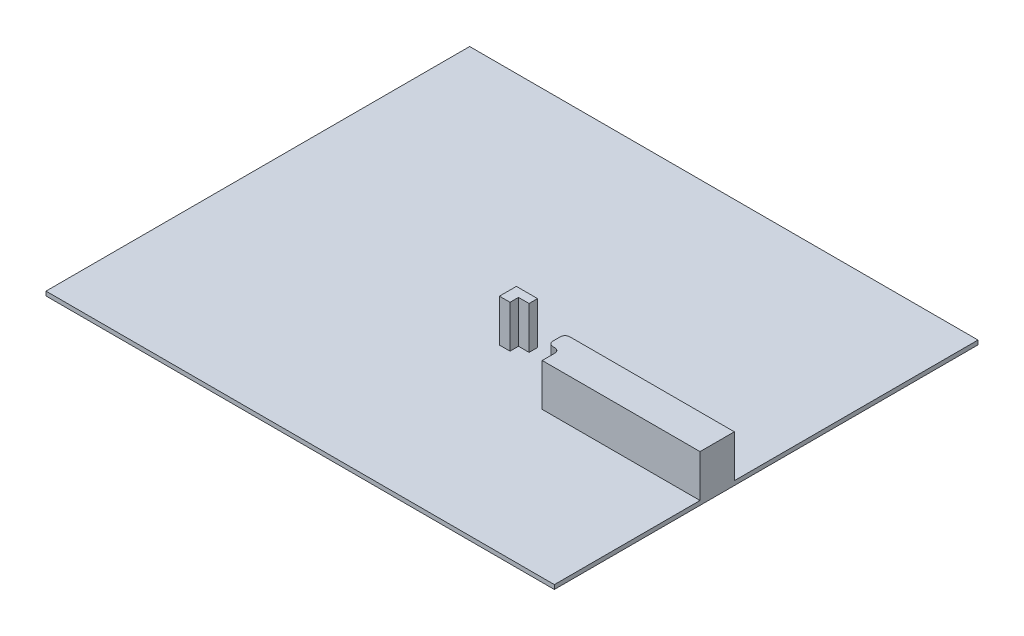
ISO-10303-21;
HEADER;
FILE_DESCRIPTION(('STEP AP214'),'2;1');
FILE_NAME('part.step','',(''),(''),'','','');
FILE_SCHEMA(('AUTOMOTIVE_DESIGN { 1 0 10303 214 1 1 1 1 }'));
ENDSEC;
DATA;
#1=APPLICATION_CONTEXT('core data for automotive mechanical design processes');
#2=APPLICATION_PROTOCOL_DEFINITION('international standard','automotive_design',2000,#1);
#3=PRODUCT_CONTEXT('',#1,'mechanical');
#4=PRODUCT('Part','Part','',(#3));
#5=PRODUCT_RELATED_PRODUCT_CATEGORY('part','',(#4));
#6=PRODUCT_DEFINITION_FORMATION('','',#4);
#7=PRODUCT_DEFINITION_CONTEXT('part definition',#1,'design');
#8=PRODUCT_DEFINITION('design','',#6,#7);
#9=PRODUCT_DEFINITION_SHAPE('','',#8);
#10=(LENGTH_UNIT() NAMED_UNIT(*) SI_UNIT(.MILLI.,.METRE.));
#11=(NAMED_UNIT(*) PLANE_ANGLE_UNIT() SI_UNIT($,.RADIAN.));
#12=(NAMED_UNIT(*) SI_UNIT($,.STERADIAN.) SOLID_ANGLE_UNIT());
#13=UNCERTAINTY_MEASURE_WITH_UNIT(LENGTH_MEASURE(1.E-05),#10,'distance_accuracy_value','');
#14=(GEOMETRIC_REPRESENTATION_CONTEXT(3) GLOBAL_UNCERTAINTY_ASSIGNED_CONTEXT((#13)) GLOBAL_UNIT_ASSIGNED_CONTEXT((#10,
#11,#12)) REPRESENTATION_CONTEXT('',''));
#15=CARTESIAN_POINT('',(0.,0.,0.));
#16=DIRECTION('',(0.,0.,1.));
#17=DIRECTION('',(1.,0.,0.));
#18=AXIS2_PLACEMENT_3D('',#15,#16,#17);
#19=CARTESIAN_POINT('',(0.,10.,0.));
#20=DIRECTION('',(0.,-1.,0.));
#21=DIRECTION('',(0.,0.,-1.));
#22=AXIS2_PLACEMENT_3D('',#19,#20,#21);
#23=PLANE('',#22);
#24=DIRECTION('',(-1.,0.,0.));
#25=VECTOR('',#24,1.);
#26=CARTESIAN_POINT('',(600.,10.,75.1731309306793));
#27=LINE('',#26,#25);
#28=CARTESIAN_POINT('',(600.,10.,75.1731309306793));
#29=VERTEX_POINT('',#28);
#30=CARTESIAN_POINT('',(211.500312891236,10.,75.1731309306794));
#31=VERTEX_POINT('',#30);
#32=EDGE_CURVE('E186',#29,#31,#27,.T.);
#33=ORIENTED_EDGE('',*,*,#32,.F.);
#34=DIRECTION('',(0.,0.,-1.));
#35=VECTOR('',#34,1.);
#36=CARTESIAN_POINT('',(600.,10.,500.));
#37=LINE('',#36,#35);
#38=CARTESIAN_POINT('',(600.,10.,-500.));
#39=VERTEX_POINT('',#38);
#40=EDGE_CURVE('E279',#29,#39,#37,.T.);
#41=ORIENTED_EDGE('',*,*,#40,.T.);
#42=DIRECTION('',(-1.,0.,0.));
#43=VECTOR('',#42,1.);
#44=CARTESIAN_POINT('',(-600.,10.,-500.));
#45=LINE('',#44,#43);
#46=CARTESIAN_POINT('',(-600.,10.,-500.));
#47=VERTEX_POINT('',#46);
#48=EDGE_CURVE('E275',#39,#47,#45,.T.);
#49=ORIENTED_EDGE('',*,*,#48,.T.);
#50=DIRECTION('',(0.,0.,1.));
#51=VECTOR('',#50,1.);
#52=CARTESIAN_POINT('',(-600.,10.,500.));
#53=LINE('',#52,#51);
#54=CARTESIAN_POINT('',(-600.,10.,500.));
#55=VERTEX_POINT('',#54);
#56=EDGE_CURVE('E301',#47,#55,#53,.T.);
#57=ORIENTED_EDGE('',*,*,#56,.T.);
#58=DIRECTION('',(1.,0.,0.));
#59=VECTOR('',#58,1.);
#60=CARTESIAN_POINT('',(-600.,10.,500.));
#61=LINE('',#60,#59);
#62=CARTESIAN_POINT('',(600.,10.,500.));
#63=VERTEX_POINT('',#62);
#64=EDGE_CURVE('E291',#55,#63,#61,.T.);
#65=ORIENTED_EDGE('',*,*,#64,.T.);
#66=CARTESIAN_POINT('',(600.,10.,156.173130930679));
#67=VERTEX_POINT('',#66);
#68=EDGE_CURVE('E281',#63,#67,#37,.T.);
#69=ORIENTED_EDGE('',*,*,#68,.T.);
#70=DIRECTION('',(1.,0.,0.));
#71=VECTOR('',#70,1.);
#72=CARTESIAN_POINT('',(227.500312891236,10.,156.173130930679));
#73=LINE('',#72,#71);
#74=CARTESIAN_POINT('',(227.500312891236,10.,156.173130930679));
#75=VERTEX_POINT('',#74);
#76=EDGE_CURVE('E199',#75,#67,#73,.T.);
#77=ORIENTED_EDGE('',*,*,#76,.F.);
#78=DIRECTION('',(0.,0.,1.));
#79=VECTOR('',#78,1.);
#80=CARTESIAN_POINT('',(227.500312891236,10.,126.173130930679));
#81=LINE('',#80,#79);
#82=CARTESIAN_POINT('',(227.500312891236,10.,126.173130930679));
#83=VERTEX_POINT('',#82);
#84=EDGE_CURVE('E231',#83,#75,#81,.T.);
#85=ORIENTED_EDGE('',*,*,#84,.F.);
#86=CARTESIAN_POINT('',(216.500312891236,10.,126.173130930679));
#87=DIRECTION('',(0.,-1.,0.));
#88=DIRECTION('',(0.,0.,1.));
#89=AXIS2_PLACEMENT_3D('',#86,#87,#88);
#90=CIRCLE('',#89,10.9999999999999);
#91=CARTESIAN_POINT('',(216.500312891236,10.,115.173130930679));
#92=VERTEX_POINT('',#91);
#93=EDGE_CURVE('E228',#92,#83,#90,.T.);
#94=ORIENTED_EDGE('',*,*,#93,.F.);
#95=DIRECTION('',(1.,0.,0.));
#96=VECTOR('',#95,1.);
#97=CARTESIAN_POINT('',(211.500312891236,10.,115.173130930679));
#98=LINE('',#97,#96);
#99=CARTESIAN_POINT('',(211.500312891236,10.,115.173130930679));
#100=VERTEX_POINT('',#99);
#101=EDGE_CURVE('E225',#100,#92,#98,.T.);
#102=ORIENTED_EDGE('',*,*,#101,.F.);
#103=CARTESIAN_POINT('',(211.500312891236,10.,104.173130930679));
#104=DIRECTION('',(0.,1.,0.));
#105=DIRECTION('',(0.,0.,1.));
#106=AXIS2_PLACEMENT_3D('',#103,#104,#105);
#107=CIRCLE('',#106,11.);
#108=CARTESIAN_POINT('',(200.500312891236,10.,104.173130930679));
#109=VERTEX_POINT('',#108);
#110=EDGE_CURVE('E222',#109,#100,#107,.T.);
#111=ORIENTED_EDGE('',*,*,#110,.F.);
#112=DIRECTION('',(0.,0.,1.));
#113=VECTOR('',#112,1.);
#114=CARTESIAN_POINT('',(200.500312891236,10.,86.1731309306794));
#115=LINE('',#114,#113);
#116=CARTESIAN_POINT('',(200.500312891236,10.,86.1731309306794));
#117=VERTEX_POINT('',#116);
#118=EDGE_CURVE('E219',#117,#109,#115,.T.);
#119=ORIENTED_EDGE('',*,*,#118,.F.);
#120=CARTESIAN_POINT('',(211.500312891236,10.,86.1731309306793));
#121=DIRECTION('',(0.,1.,0.));
#122=DIRECTION('',(0.,0.,1.));
#123=AXIS2_PLACEMENT_3D('',#120,#121,#122);
#124=CIRCLE('',#123,11.);
#125=EDGE_CURVE('E189',#31,#117,#124,.T.);
#126=ORIENTED_EDGE('',*,*,#125,.F.);
#127=EDGE_LOOP('',(#33,#41,#49,#57,#65,#69,#77,#85,#94,#102,#111,#119,#126));
#128=FACE_BOUND('',#127,.T.);
#129=DIRECTION('',(-1.,0.,0.));
#130=VECTOR('',#129,1.);
#131=CARTESIAN_POINT('',(95.5003128912362,10.,35.1731309306794));
#132=LINE('',#131,#130);
#133=CARTESIAN_POINT('',(95.5003128912362,10.,35.1731309306794));
#134=VERTEX_POINT('',#133);
#135=CARTESIAN_POINT('',(45.5003128912363,10.,35.1731309306794));
#136=VERTEX_POINT('',#135);
#137=EDGE_CURVE('E185',#134,#136,#132,.T.);
#138=ORIENTED_EDGE('',*,*,#137,.F.);
#139=DIRECTION('',(0.,0.,-1.));
#140=VECTOR('',#139,1.);
#141=CARTESIAN_POINT('',(95.5003128912362,10.,55.1731309306794));
#142=LINE('',#141,#140);
#143=CARTESIAN_POINT('',(95.5003128912362,10.,55.1731309306794));
#144=VERTEX_POINT('',#143);
#145=EDGE_CURVE('E182',#144,#134,#142,.T.);
#146=ORIENTED_EDGE('',*,*,#145,.F.);
#147=DIRECTION('',(1.,0.,0.));
#148=VECTOR('',#147,1.);
#149=CARTESIAN_POINT('',(95.5003128912362,10.,55.1731309306794));
#150=LINE('',#149,#148);
#151=CARTESIAN_POINT('',(70.5003128912363,10.,55.1731309306794));
#152=VERTEX_POINT('',#151);
#153=EDGE_CURVE('E544',#152,#144,#150,.T.);
#154=ORIENTED_EDGE('',*,*,#153,.F.);
#155=DIRECTION('',(0.,0.,-1.));
#156=VECTOR('',#155,1.);
#157=CARTESIAN_POINT('',(70.5003128912363,10.,55.1731309306794));
#158=LINE('',#157,#156);
#159=CARTESIAN_POINT('',(70.5003128912363,10.,75.1731309306794));
#160=VERTEX_POINT('',#159);
#161=EDGE_CURVE('E559',#160,#152,#158,.T.);
#162=ORIENTED_EDGE('',*,*,#161,.F.);
#163=DIRECTION('',(1.,0.,0.));
#164=VECTOR('',#163,1.);
#165=CARTESIAN_POINT('',(45.5003128912363,10.,75.1731309306794));
#166=LINE('',#165,#164);
#167=CARTESIAN_POINT('',(45.5003128912363,10.,75.1731309306794));
#168=VERTEX_POINT('',#167);
#169=EDGE_CURVE('E54',#168,#160,#166,.T.);
#170=ORIENTED_EDGE('',*,*,#169,.F.);
#171=DIRECTION('',(0.,0.,1.));
#172=VECTOR('',#171,1.);
#173=CARTESIAN_POINT('',(45.5003128912363,10.,35.1731309306794));
#174=LINE('',#173,#172);
#175=EDGE_CURVE('E49',#136,#168,#174,.T.);
#176=ORIENTED_EDGE('',*,*,#175,.F.);
#177=EDGE_LOOP('',(#138,#146,#154,#162,#170,#176));
#178=FACE_BOUND('',#177,.T.);
#179=ADVANCED_FACE('F32',(#128,#178),#23,.F.);
#180=CARTESIAN_POINT('',(600.,10.,500.));
#181=DIRECTION('',(-1.,0.,0.));
#182=DIRECTION('',(0.,0.,1.));
#183=AXIS2_PLACEMENT_3D('',#180,#181,#182);
#184=PLANE('',#183);
#185=DIRECTION('',(0.,0.,-1.));
#186=VECTOR('',#185,1.);
#187=CARTESIAN_POINT('',(600.,0.,500.));
#188=LINE('',#187,#186);
#189=CARTESIAN_POINT('',(600.,0.,500.));
#190=VERTEX_POINT('',#189);
#191=CARTESIAN_POINT('',(600.,0.,-500.));
#192=VERTEX_POINT('',#191);
#193=EDGE_CURVE('E298',#190,#192,#188,.T.);
#194=ORIENTED_EDGE('',*,*,#193,.T.);
#195=DIRECTION('',(0.,-1.,0.));
#196=VECTOR('',#195,1.);
#197=CARTESIAN_POINT('',(600.,10.,-500.));
#198=LINE('',#197,#196);
#199=EDGE_CURVE('E11',#39,#192,#198,.T.);
#200=ORIENTED_EDGE('',*,*,#199,.F.);
#201=ORIENTED_EDGE('',*,*,#40,.F.);
#202=DIRECTION('',(0.,-1.,0.));
#203=VECTOR('',#202,1.);
#204=CARTESIAN_POINT('',(600.,110.,75.1731309306793));
#205=LINE('',#204,#203);
#206=CARTESIAN_POINT('',(600.,110.,75.1731309306793));
#207=VERTEX_POINT('',#206);
#208=EDGE_CURVE('E272',#207,#29,#205,.T.);
#209=ORIENTED_EDGE('',*,*,#208,.F.);
#210=DIRECTION('',(0.,0.,-1.));
#211=VECTOR('',#210,1.);
#212=CARTESIAN_POINT('',(600.,110.,75.1731309306793));
#213=LINE('',#212,#211);
#214=CARTESIAN_POINT('',(600.,110.,156.173130930679));
#215=VERTEX_POINT('',#214);
#216=EDGE_CURVE('E195',#215,#207,#213,.T.);
#217=ORIENTED_EDGE('',*,*,#216,.F.);
#218=DIRECTION('',(0.,-1.,0.));
#219=VECTOR('',#218,1.);
#220=CARTESIAN_POINT('',(600.,110.,156.173130930679));
#221=LINE('',#220,#219);
#222=EDGE_CURVE('E216',#215,#67,#221,.T.);
#223=ORIENTED_EDGE('',*,*,#222,.T.);
#224=ORIENTED_EDGE('',*,*,#68,.F.);
#225=DIRECTION('',(0.,-1.,0.));
#226=VECTOR('',#225,1.);
#227=CARTESIAN_POINT('',(600.,10.,500.));
#228=LINE('',#227,#226);
#229=EDGE_CURVE('E288',#63,#190,#228,.T.);
#230=ORIENTED_EDGE('',*,*,#229,.T.);
#231=EDGE_LOOP('',(#194,#200,#201,#209,#217,#223,#224,#230));
#232=FACE_BOUND('',#231,.T.);
#233=ADVANCED_FACE('F34',(#232),#184,.F.);
#234=CARTESIAN_POINT('',(-600.,10.,-500.));
#235=DIRECTION('',(0.,0.,1.));
#236=DIRECTION('',(1.,0.,0.));
#237=AXIS2_PLACEMENT_3D('',#234,#235,#236);
#238=PLANE('',#237);
#239=DIRECTION('',(-1.,0.,0.));
#240=VECTOR('',#239,1.);
#241=CARTESIAN_POINT('',(-600.,0.,-500.));
#242=LINE('',#241,#240);
#243=CARTESIAN_POINT('',(-600.,0.,-500.));
#244=VERTEX_POINT('',#243);
#245=EDGE_CURVE('E296',#192,#244,#242,.T.);
#246=ORIENTED_EDGE('',*,*,#245,.T.);
#247=DIRECTION('',(0.,-1.,0.));
#248=VECTOR('',#247,1.);
#249=CARTESIAN_POINT('',(-600.,10.,-500.));
#250=LINE('',#249,#248);
#251=EDGE_CURVE('E41',#47,#244,#250,.T.);
#252=ORIENTED_EDGE('',*,*,#251,.F.);
#253=ORIENTED_EDGE('',*,*,#48,.F.);
#254=ORIENTED_EDGE('',*,*,#199,.T.);
#255=EDGE_LOOP('',(#246,#252,#253,#254));
#256=FACE_BOUND('',#255,.T.);
#257=ADVANCED_FACE('F310',(#256),#238,.F.);
#258=CARTESIAN_POINT('',(-600.,10.,500.));
#259=DIRECTION('',(1.,0.,0.));
#260=DIRECTION('',(0.,0.,-1.));
#261=AXIS2_PLACEMENT_3D('',#258,#259,#260);
#262=PLANE('',#261);
#263=DIRECTION('',(0.,0.,1.));
#264=VECTOR('',#263,1.);
#265=CARTESIAN_POINT('',(-600.,0.,500.));
#266=LINE('',#265,#264);
#267=CARTESIAN_POINT('',(-600.,0.,500.));
#268=VERTEX_POINT('',#267);
#269=EDGE_CURVE('E294',#244,#268,#266,.T.);
#270=ORIENTED_EDGE('',*,*,#269,.T.);
#271=DIRECTION('',(0.,-1.,0.));
#272=VECTOR('',#271,1.);
#273=CARTESIAN_POINT('',(-600.,10.,500.));
#274=LINE('',#273,#272);
#275=EDGE_CURVE('E285',#55,#268,#274,.T.);
#276=ORIENTED_EDGE('',*,*,#275,.F.);
#277=ORIENTED_EDGE('',*,*,#56,.F.);
#278=ORIENTED_EDGE('',*,*,#251,.T.);
#279=EDGE_LOOP('',(#270,#276,#277,#278));
#280=FACE_BOUND('',#279,.T.);
#281=ADVANCED_FACE('F313',(#280),#262,.F.);
#282=CARTESIAN_POINT('',(-600.,10.,500.));
#283=DIRECTION('',(0.,0.,-1.));
#284=DIRECTION('',(-1.,0.,0.));
#285=AXIS2_PLACEMENT_3D('',#282,#283,#284);
#286=PLANE('',#285);
#287=DIRECTION('',(1.,0.,0.));
#288=VECTOR('',#287,1.);
#289=CARTESIAN_POINT('',(-600.,0.,500.));
#290=LINE('',#289,#288);
#291=EDGE_CURVE('E292',#268,#190,#290,.T.);
#292=ORIENTED_EDGE('',*,*,#291,.T.);
#293=ORIENTED_EDGE('',*,*,#229,.F.);
#294=ORIENTED_EDGE('',*,*,#64,.F.);
#295=ORIENTED_EDGE('',*,*,#275,.T.);
#296=EDGE_LOOP('',(#292,#293,#294,#295));
#297=FACE_BOUND('',#296,.T.);
#298=ADVANCED_FACE('F318',(#297),#286,.F.);
#299=CARTESIAN_POINT('',(0.,0.,0.));
#300=DIRECTION('',(0.,-1.,0.));
#301=DIRECTION('',(0.,0.,-1.));
#302=AXIS2_PLACEMENT_3D('',#299,#300,#301);
#303=PLANE('',#302);
#304=ORIENTED_EDGE('',*,*,#193,.F.);
#305=ORIENTED_EDGE('',*,*,#291,.F.);
#306=ORIENTED_EDGE('',*,*,#269,.F.);
#307=ORIENTED_EDGE('',*,*,#245,.F.);
#308=EDGE_LOOP('',(#304,#305,#306,#307));
#309=FACE_BOUND('',#308,.T.);
#310=ADVANCED_FACE('F349',(#309),#303,.T.);
#311=CARTESIAN_POINT('',(600.,110.,75.1731309306793));
#312=DIRECTION('',(0.,0.,1.));
#313=DIRECTION('',(1.,0.,0.));
#314=AXIS2_PLACEMENT_3D('',#311,#312,#313);
#315=PLANE('',#314);
#316=ORIENTED_EDGE('',*,*,#32,.T.);
#317=DIRECTION('',(0.,-1.,0.));
#318=VECTOR('',#317,1.);
#319=CARTESIAN_POINT('',(211.500312891236,110.,75.1731309306794));
#320=LINE('',#319,#318);
#321=CARTESIAN_POINT('',(211.500312891236,110.,75.1731309306794));
#322=VERTEX_POINT('',#321);
#323=EDGE_CURVE('E269',#322,#31,#320,.T.);
#324=ORIENTED_EDGE('',*,*,#323,.F.);
#325=DIRECTION('',(-1.,0.,0.));
#326=VECTOR('',#325,1.);
#327=CARTESIAN_POINT('',(600.,110.,75.1731309306793));
#328=LINE('',#327,#326);
#329=EDGE_CURVE('E198',#207,#322,#328,.T.);
#330=ORIENTED_EDGE('',*,*,#329,.F.);
#331=ORIENTED_EDGE('',*,*,#208,.T.);
#332=EDGE_LOOP('',(#316,#324,#330,#331));
#333=FACE_BOUND('',#332,.T.);
#334=ADVANCED_FACE('F345',(#333),#315,.F.);
#335=CARTESIAN_POINT('',(211.500312891236,110.,86.1731309306793));
#336=DIRECTION('',(0.,-1.,0.));
#337=DIRECTION('',(0.,0.,-1.));
#338=AXIS2_PLACEMENT_3D('',#335,#336,#337);
#339=CYLINDRICAL_SURFACE('',#338,11.);
#340=ORIENTED_EDGE('',*,*,#125,.T.);
#341=DIRECTION('',(0.,-1.,0.));
#342=VECTOR('',#341,1.);
#343=CARTESIAN_POINT('',(200.500312891236,110.,86.1731309306794));
#344=LINE('',#343,#342);
#345=CARTESIAN_POINT('',(200.500312891236,110.,86.1731309306794));
#346=VERTEX_POINT('',#345);
#347=EDGE_CURVE('E266',#346,#117,#344,.T.);
#348=ORIENTED_EDGE('',*,*,#347,.F.);
#349=CARTESIAN_POINT('',(211.500312891236,110.,86.1731309306793));
#350=DIRECTION('',(0.,1.,0.));
#351=DIRECTION('',(0.,0.,1.));
#352=AXIS2_PLACEMENT_3D('',#349,#350,#351);
#353=CIRCLE('',#352,11.);
#354=EDGE_CURVE('E201',#322,#346,#353,.T.);
#355=ORIENTED_EDGE('',*,*,#354,.F.);
#356=ORIENTED_EDGE('',*,*,#323,.T.);
#357=EDGE_LOOP('',(#340,#348,#355,#356));
#358=FACE_BOUND('',#357,.T.);
#359=ADVANCED_FACE('F341',(#358),#339,.T.);
#360=CARTESIAN_POINT('',(200.500312891236,110.,86.1731309306794));
#361=DIRECTION('',(1.,0.,0.));
#362=DIRECTION('',(0.,0.,-1.));
#363=AXIS2_PLACEMENT_3D('',#360,#361,#362);
#364=PLANE('',#363);
#365=ORIENTED_EDGE('',*,*,#118,.T.);
#366=DIRECTION('',(0.,-1.,0.));
#367=VECTOR('',#366,1.);
#368=CARTESIAN_POINT('',(200.500312891236,110.,104.173130930679));
#369=LINE('',#368,#367);
#370=CARTESIAN_POINT('',(200.500312891236,110.,104.173130930679));
#371=VERTEX_POINT('',#370);
#372=EDGE_CURVE('E263',#371,#109,#369,.T.);
#373=ORIENTED_EDGE('',*,*,#372,.F.);
#374=DIRECTION('',(0.,0.,1.));
#375=VECTOR('',#374,1.);
#376=CARTESIAN_POINT('',(200.500312891236,110.,86.1731309306794));
#377=LINE('',#376,#375);
#378=EDGE_CURVE('E203',#346,#371,#377,.T.);
#379=ORIENTED_EDGE('',*,*,#378,.F.);
#380=ORIENTED_EDGE('',*,*,#347,.T.);
#381=EDGE_LOOP('',(#365,#373,#379,#380));
#382=FACE_BOUND('',#381,.T.);
#383=ADVANCED_FACE('F338',(#382),#364,.F.);
#384=CARTESIAN_POINT('',(211.500312891236,110.,104.173130930679));
#385=DIRECTION('',(0.,-1.,0.));
#386=DIRECTION('',(0.,0.,-1.));
#387=AXIS2_PLACEMENT_3D('',#384,#385,#386);
#388=CYLINDRICAL_SURFACE('',#387,11.);
#389=ORIENTED_EDGE('',*,*,#110,.T.);
#390=DIRECTION('',(0.,-1.,0.));
#391=VECTOR('',#390,1.);
#392=CARTESIAN_POINT('',(211.500312891236,110.,115.173130930679));
#393=LINE('',#392,#391);
#394=CARTESIAN_POINT('',(211.500312891236,110.,115.173130930679));
#395=VERTEX_POINT('',#394);
#396=EDGE_CURVE('E258',#395,#100,#393,.T.);
#397=ORIENTED_EDGE('',*,*,#396,.F.);
#398=CARTESIAN_POINT('',(211.500312891236,110.,104.173130930679));
#399=DIRECTION('',(0.,1.,0.));
#400=DIRECTION('',(0.,0.,1.));
#401=AXIS2_PLACEMENT_3D('',#398,#399,#400);
#402=CIRCLE('',#401,11.);
#403=EDGE_CURVE('E205',#371,#395,#402,.T.);
#404=ORIENTED_EDGE('',*,*,#403,.F.);
#405=ORIENTED_EDGE('',*,*,#372,.T.);
#406=EDGE_LOOP('',(#389,#397,#404,#405));
#407=FACE_BOUND('',#406,.T.);
#408=ADVANCED_FACE('F333',(#407),#388,.T.);
#409=CARTESIAN_POINT('',(211.500312891236,110.,115.173130930679));
#410=DIRECTION('',(0.,0.,-1.));
#411=DIRECTION('',(-1.,0.,0.));
#412=AXIS2_PLACEMENT_3D('',#409,#410,#411);
#413=PLANE('',#412);
#414=ORIENTED_EDGE('',*,*,#101,.T.);
#415=DIRECTION('',(0.,-1.,0.));
#416=VECTOR('',#415,1.);
#417=CARTESIAN_POINT('',(216.500312891236,110.,115.173130930679));
#418=LINE('',#417,#416);
#419=CARTESIAN_POINT('',(216.500312891236,110.,115.173130930679));
#420=VERTEX_POINT('',#419);
#421=EDGE_CURVE('E253',#420,#92,#418,.T.);
#422=ORIENTED_EDGE('',*,*,#421,.F.);
#423=DIRECTION('',(1.,0.,0.));
#424=VECTOR('',#423,1.);
#425=CARTESIAN_POINT('',(211.500312891236,110.,115.173130930679));
#426=LINE('',#425,#424);
#427=EDGE_CURVE('E207',#395,#420,#426,.T.);
#428=ORIENTED_EDGE('',*,*,#427,.F.);
#429=ORIENTED_EDGE('',*,*,#396,.T.);
#430=EDGE_LOOP('',(#414,#422,#428,#429));
#431=FACE_BOUND('',#430,.T.);
#432=ADVANCED_FACE('F330',(#431),#413,.F.);
#433=CARTESIAN_POINT('',(216.500312891236,110.,126.173130930679));
#434=DIRECTION('',(0.,-1.,0.));
#435=DIRECTION('',(0.,0.,-1.));
#436=AXIS2_PLACEMENT_3D('',#433,#434,#435);
#437=CYLINDRICAL_SURFACE('',#436,10.9999999999999);
#438=ORIENTED_EDGE('',*,*,#93,.T.);
#439=DIRECTION('',(0.,-1.,0.));
#440=VECTOR('',#439,1.);
#441=CARTESIAN_POINT('',(227.500312891236,110.,126.173130930679));
#442=LINE('',#441,#440);
#443=CARTESIAN_POINT('',(227.500312891236,110.,126.173130930679));
#444=VERTEX_POINT('',#443);
#445=EDGE_CURVE('E248',#444,#83,#442,.T.);
#446=ORIENTED_EDGE('',*,*,#445,.F.);
#447=CARTESIAN_POINT('',(216.500312891236,110.,126.173130930679));
#448=DIRECTION('',(0.,-1.,0.));
#449=DIRECTION('',(0.,0.,1.));
#450=AXIS2_PLACEMENT_3D('',#447,#448,#449);
#451=CIRCLE('',#450,10.9999999999999);
#452=EDGE_CURVE('E209',#420,#444,#451,.T.);
#453=ORIENTED_EDGE('',*,*,#452,.F.);
#454=ORIENTED_EDGE('',*,*,#421,.T.);
#455=EDGE_LOOP('',(#438,#446,#453,#454));
#456=FACE_BOUND('',#455,.T.);
#457=ADVANCED_FACE('F326',(#456),#437,.F.);
#458=CARTESIAN_POINT('',(227.500312891236,110.,126.173130930679));
#459=DIRECTION('',(1.,0.,0.));
#460=DIRECTION('',(0.,0.,-1.));
#461=AXIS2_PLACEMENT_3D('',#458,#459,#460);
#462=PLANE('',#461);
#463=ORIENTED_EDGE('',*,*,#84,.T.);
#464=DIRECTION('',(0.,-1.,0.));
#465=VECTOR('',#464,1.);
#466=CARTESIAN_POINT('',(227.500312891236,110.,156.173130930679));
#467=LINE('',#466,#465);
#468=CARTESIAN_POINT('',(227.500312891236,110.,156.173130930679));
#469=VERTEX_POINT('',#468);
#470=EDGE_CURVE('E236',#469,#75,#467,.T.);
#471=ORIENTED_EDGE('',*,*,#470,.F.);
#472=DIRECTION('',(0.,0.,1.));
#473=VECTOR('',#472,1.);
#474=CARTESIAN_POINT('',(227.500312891236,110.,126.173130930679));
#475=LINE('',#474,#473);
#476=EDGE_CURVE('E211',#444,#469,#475,.T.);
#477=ORIENTED_EDGE('',*,*,#476,.F.);
#478=ORIENTED_EDGE('',*,*,#445,.T.);
#479=EDGE_LOOP('',(#463,#471,#477,#478));
#480=FACE_BOUND('',#479,.T.);
#481=ADVANCED_FACE('F324',(#480),#462,.F.);
#482=CARTESIAN_POINT('',(227.500312891236,110.,156.173130930679));
#483=DIRECTION('',(0.,0.,-1.));
#484=DIRECTION('',(-1.,0.,0.));
#485=AXIS2_PLACEMENT_3D('',#482,#483,#484);
#486=PLANE('',#485);
#487=ORIENTED_EDGE('',*,*,#76,.T.);
#488=ORIENTED_EDGE('',*,*,#222,.F.);
#489=DIRECTION('',(1.,0.,0.));
#490=VECTOR('',#489,1.);
#491=CARTESIAN_POINT('',(227.500312891236,110.,156.173130930679));
#492=LINE('',#491,#490);
#493=EDGE_CURVE('E213',#469,#215,#492,.T.);
#494=ORIENTED_EDGE('',*,*,#493,.F.);
#495=ORIENTED_EDGE('',*,*,#470,.T.);
#496=EDGE_LOOP('',(#487,#488,#494,#495));
#497=FACE_BOUND('',#496,.T.);
#498=ADVANCED_FACE('F319',(#497),#486,.F.);
#499=CARTESIAN_POINT('',(216.500312891236,110.,126.173130930679));
#500=DIRECTION('',(0.,1.,0.));
#501=DIRECTION('',(0.,0.,1.));
#502=AXIS2_PLACEMENT_3D('',#499,#500,#501);
#503=PLANE('',#502);
#504=ORIENTED_EDGE('',*,*,#216,.T.);
#505=ORIENTED_EDGE('',*,*,#329,.T.);
#506=ORIENTED_EDGE('',*,*,#354,.T.);
#507=ORIENTED_EDGE('',*,*,#378,.T.);
#508=ORIENTED_EDGE('',*,*,#403,.T.);
#509=ORIENTED_EDGE('',*,*,#427,.T.);
#510=ORIENTED_EDGE('',*,*,#452,.T.);
#511=ORIENTED_EDGE('',*,*,#476,.T.);
#512=ORIENTED_EDGE('',*,*,#493,.T.);
#513=EDGE_LOOP('',(#504,#505,#506,#507,#508,#509,#510,#511,#512));
#514=FACE_BOUND('',#513,.T.);
#515=ADVANCED_FACE('F321',(#514),#503,.T.);
#516=CARTESIAN_POINT('',(95.5003128912362,110.,35.1731309306794));
#517=DIRECTION('',(0.,0.,1.));
#518=DIRECTION('',(1.,0.,0.));
#519=AXIS2_PLACEMENT_3D('',#516,#517,#518);
#520=PLANE('',#519);
#521=ORIENTED_EDGE('',*,*,#137,.T.);
#522=DIRECTION('',(0.,-1.,0.));
#523=VECTOR('',#522,1.);
#524=CARTESIAN_POINT('',(45.5003128912363,110.,35.1731309306794));
#525=LINE('',#524,#523);
#526=CARTESIAN_POINT('',(45.5003128912363,110.,35.1731309306794));
#527=VERTEX_POINT('',#526);
#528=EDGE_CURVE('E166',#527,#136,#525,.T.);
#529=ORIENTED_EDGE('',*,*,#528,.F.);
#530=DIRECTION('',(-1.,0.,0.));
#531=VECTOR('',#530,1.);
#532=CARTESIAN_POINT('',(95.5003128912362,110.,35.1731309306794));
#533=LINE('',#532,#531);
#534=CARTESIAN_POINT('',(95.5003128912362,110.,35.1731309306794));
#535=VERTEX_POINT('',#534);
#536=EDGE_CURVE('E173',#535,#527,#533,.T.);
#537=ORIENTED_EDGE('',*,*,#536,.F.);
#538=DIRECTION('',(0.,-1.,0.));
#539=VECTOR('',#538,1.);
#540=CARTESIAN_POINT('',(95.5003128912362,110.,35.1731309306794));
#541=LINE('',#540,#539);
#542=EDGE_CURVE('E540',#535,#134,#541,.T.);
#543=ORIENTED_EDGE('',*,*,#542,.T.);
#544=EDGE_LOOP('',(#521,#529,#537,#543));
#545=FACE_BOUND('',#544,.T.);
#546=ADVANCED_FACE('F184',(#545),#520,.F.);
#547=CARTESIAN_POINT('',(45.5003128912363,110.,35.1731309306794));
#548=DIRECTION('',(1.,0.,0.));
#549=DIRECTION('',(0.,0.,-1.));
#550=AXIS2_PLACEMENT_3D('',#547,#548,#549);
#551=PLANE('',#550);
#552=ORIENTED_EDGE('',*,*,#175,.T.);
#553=DIRECTION('',(0.,-1.,0.));
#554=VECTOR('',#553,1.);
#555=CARTESIAN_POINT('',(45.5003128912363,110.,75.1731309306794));
#556=LINE('',#555,#554);
#557=CARTESIAN_POINT('',(45.5003128912363,110.,75.1731309306794));
#558=VERTEX_POINT('',#557);
#559=EDGE_CURVE('E169',#558,#168,#556,.T.);
#560=ORIENTED_EDGE('',*,*,#559,.F.);
#561=DIRECTION('',(0.,0.,1.));
#562=VECTOR('',#561,1.);
#563=CARTESIAN_POINT('',(45.5003128912363,110.,35.1731309306794));
#564=LINE('',#563,#562);
#565=EDGE_CURVE('E162',#527,#558,#564,.T.);
#566=ORIENTED_EDGE('',*,*,#565,.F.);
#567=ORIENTED_EDGE('',*,*,#528,.T.);
#568=EDGE_LOOP('',(#552,#560,#566,#567));
#569=FACE_BOUND('',#568,.T.);
#570=ADVANCED_FACE('F164',(#569),#551,.F.);
#571=CARTESIAN_POINT('',(45.5003128912363,110.,75.1731309306794));
#572=DIRECTION('',(0.,0.,-1.));
#573=DIRECTION('',(-1.,0.,0.));
#574=AXIS2_PLACEMENT_3D('',#571,#572,#573);
#575=PLANE('',#574);
#576=ORIENTED_EDGE('',*,*,#169,.T.);
#577=DIRECTION('',(0.,-1.,0.));
#578=VECTOR('',#577,1.);
#579=CARTESIAN_POINT('',(70.5003128912363,110.,75.1731309306794));
#580=LINE('',#579,#578);
#581=CARTESIAN_POINT('',(70.5003128912363,110.,75.1731309306794));
#582=VERTEX_POINT('',#581);
#583=EDGE_CURVE('E191',#582,#160,#580,.T.);
#584=ORIENTED_EDGE('',*,*,#583,.F.);
#585=DIRECTION('',(1.,0.,0.));
#586=VECTOR('',#585,1.);
#587=CARTESIAN_POINT('',(45.5003128912363,110.,75.1731309306794));
#588=LINE('',#587,#586);
#589=EDGE_CURVE('E172',#558,#582,#588,.T.);
#590=ORIENTED_EDGE('',*,*,#589,.F.);
#591=ORIENTED_EDGE('',*,*,#559,.T.);
#592=EDGE_LOOP('',(#576,#584,#590,#591));
#593=FACE_BOUND('',#592,.T.);
#594=ADVANCED_FACE('F384',(#593),#575,.F.);
#595=CARTESIAN_POINT('',(70.5003128912363,110.,55.1731309306794));
#596=DIRECTION('',(-1.,0.,0.));
#597=DIRECTION('',(0.,0.,1.));
#598=AXIS2_PLACEMENT_3D('',#595,#596,#597);
#599=PLANE('',#598);
#600=ORIENTED_EDGE('',*,*,#161,.T.);
#601=DIRECTION('',(0.,-1.,0.));
#602=VECTOR('',#601,1.);
#603=CARTESIAN_POINT('',(70.5003128912363,110.,55.1731309306794));
#604=LINE('',#603,#602);
#605=CARTESIAN_POINT('',(70.5003128912363,110.,55.1731309306794));
#606=VERTEX_POINT('',#605);
#607=EDGE_CURVE('E547',#606,#152,#604,.T.);
#608=ORIENTED_EDGE('',*,*,#607,.F.);
#609=DIRECTION('',(0.,0.,-1.));
#610=VECTOR('',#609,1.);
#611=CARTESIAN_POINT('',(70.5003128912363,110.,55.1731309306794));
#612=LINE('',#611,#610);
#613=EDGE_CURVE('E560',#582,#606,#612,.T.);
#614=ORIENTED_EDGE('',*,*,#613,.F.);
#615=ORIENTED_EDGE('',*,*,#583,.T.);
#616=EDGE_LOOP('',(#600,#608,#614,#615));
#617=FACE_BOUND('',#616,.T.);
#618=ADVANCED_FACE('F387',(#617),#599,.F.);
#619=CARTESIAN_POINT('',(95.5003128912362,110.,55.1731309306794));
#620=DIRECTION('',(0.,0.,-1.));
#621=DIRECTION('',(-1.,0.,0.));
#622=AXIS2_PLACEMENT_3D('',#619,#620,#621);
#623=PLANE('',#622);
#624=ORIENTED_EDGE('',*,*,#153,.T.);
#625=DIRECTION('',(0.,-1.,0.));
#626=VECTOR('',#625,1.);
#627=CARTESIAN_POINT('',(95.5003128912362,110.,55.1731309306794));
#628=LINE('',#627,#626);
#629=CARTESIAN_POINT('',(95.5003128912362,110.,55.1731309306794));
#630=VERTEX_POINT('',#629);
#631=EDGE_CURVE('E542',#630,#144,#628,.T.);
#632=ORIENTED_EDGE('',*,*,#631,.F.);
#633=DIRECTION('',(1.,0.,0.));
#634=VECTOR('',#633,1.);
#635=CARTESIAN_POINT('',(95.5003128912362,110.,55.1731309306794));
#636=LINE('',#635,#634);
#637=EDGE_CURVE('E549',#606,#630,#636,.T.);
#638=ORIENTED_EDGE('',*,*,#637,.F.);
#639=ORIENTED_EDGE('',*,*,#607,.T.);
#640=EDGE_LOOP('',(#624,#632,#638,#639));
#641=FACE_BOUND('',#640,.T.);
#642=ADVANCED_FACE('F391',(#641),#623,.F.);
#643=CARTESIAN_POINT('',(95.5003128912362,110.,55.1731309306794));
#644=DIRECTION('',(-1.,0.,0.));
#645=DIRECTION('',(0.,0.,1.));
#646=AXIS2_PLACEMENT_3D('',#643,#644,#645);
#647=PLANE('',#646);
#648=ORIENTED_EDGE('',*,*,#145,.T.);
#649=ORIENTED_EDGE('',*,*,#542,.F.);
#650=DIRECTION('',(0.,0.,-1.));
#651=VECTOR('',#650,1.);
#652=CARTESIAN_POINT('',(95.5003128912362,110.,55.1731309306794));
#653=LINE('',#652,#651);
#654=EDGE_CURVE('E178',#630,#535,#653,.T.);
#655=ORIENTED_EDGE('',*,*,#654,.F.);
#656=ORIENTED_EDGE('',*,*,#631,.T.);
#657=EDGE_LOOP('',(#648,#649,#655,#656));
#658=FACE_BOUND('',#657,.T.);
#659=ADVANCED_FACE('F395',(#658),#647,.F.);
#660=CARTESIAN_POINT('',(0.,110.,0.));
#661=DIRECTION('',(0.,1.,0.));
#662=DIRECTION('',(0.,0.,1.));
#663=AXIS2_PLACEMENT_3D('',#660,#661,#662);
#664=PLANE('',#663);
#665=ORIENTED_EDGE('',*,*,#536,.T.);
#666=ORIENTED_EDGE('',*,*,#565,.T.);
#667=ORIENTED_EDGE('',*,*,#589,.T.);
#668=ORIENTED_EDGE('',*,*,#613,.T.);
#669=ORIENTED_EDGE('',*,*,#637,.T.);
#670=ORIENTED_EDGE('',*,*,#654,.T.);
#671=EDGE_LOOP('',(#665,#666,#667,#668,#669,#670));
#672=FACE_BOUND('',#671,.T.);
#673=ADVANCED_FACE('F176',(#672),#664,.T.);
#674=CLOSED_SHELL('',(#179,#233,#257,#281,#298,#310,#334,#359,#383,#408,#432,#457,#481,#498,
#515,#546,#570,#594,#618,#642,#659,#673));
#675=MANIFOLD_SOLID_BREP('B2',#674);
#676=ADVANCED_BREP_SHAPE_REPRESENTATION('',(#18,#675),#14);
#677=SHAPE_DEFINITION_REPRESENTATION(#9,#676);
ENDSEC;
END-ISO-10303-21;
